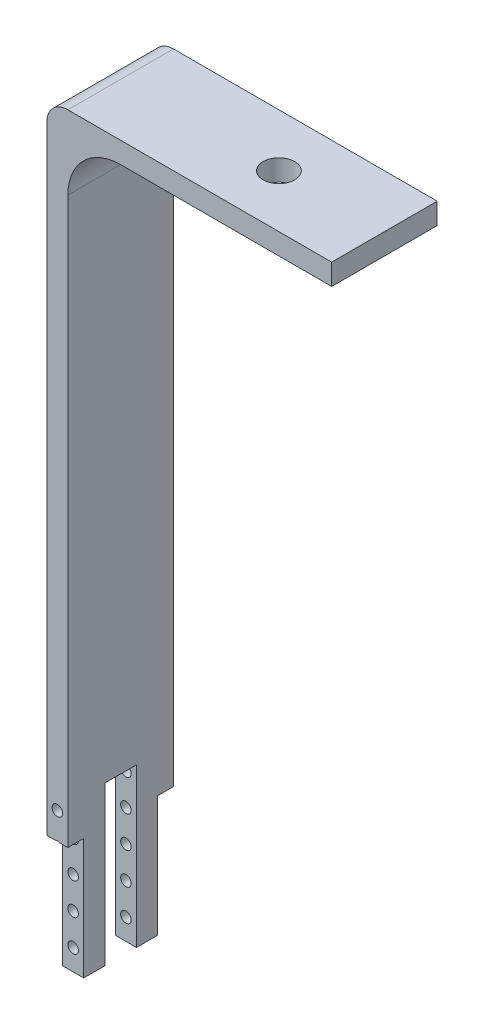
ISO-10303-21;
HEADER;
FILE_DESCRIPTION(('STEP AP214'),'2;1');
FILE_NAME('part.step','',(''),(''),'','','');
FILE_SCHEMA(('AUTOMOTIVE_DESIGN { 1 0 10303 214 1 1 1 1 }'));
ENDSEC;
DATA;
#1=APPLICATION_CONTEXT('core data for automotive mechanical design processes');
#2=APPLICATION_PROTOCOL_DEFINITION('international standard','automotive_design',2000,#1);
#3=PRODUCT_CONTEXT('',#1,'mechanical');
#4=PRODUCT('Part','Part','',(#3));
#5=PRODUCT_RELATED_PRODUCT_CATEGORY('part','',(#4));
#6=PRODUCT_DEFINITION_FORMATION('','',#4);
#7=PRODUCT_DEFINITION_CONTEXT('part definition',#1,'design');
#8=PRODUCT_DEFINITION('design','',#6,#7);
#9=PRODUCT_DEFINITION_SHAPE('','',#8);
#10=(LENGTH_UNIT() NAMED_UNIT(*) SI_UNIT(.MILLI.,.METRE.));
#11=(NAMED_UNIT(*) PLANE_ANGLE_UNIT() SI_UNIT($,.RADIAN.));
#12=(NAMED_UNIT(*) SI_UNIT($,.STERADIAN.) SOLID_ANGLE_UNIT());
#13=UNCERTAINTY_MEASURE_WITH_UNIT(LENGTH_MEASURE(1.E-05),#10,'distance_accuracy_value','');
#14=(GEOMETRIC_REPRESENTATION_CONTEXT(3) GLOBAL_UNCERTAINTY_ASSIGNED_CONTEXT((#13)) GLOBAL_UNIT_ASSIGNED_CONTEXT((#10,
#11,#12)) REPRESENTATION_CONTEXT('',''));
#15=CARTESIAN_POINT('',(0.,0.,0.));
#16=DIRECTION('',(0.,0.,1.));
#17=DIRECTION('',(1.,0.,0.));
#18=AXIS2_PLACEMENT_3D('',#15,#16,#17);
#19=CARTESIAN_POINT('',(-39.7987972115879,-20.1415462708194,1.5));
#20=DIRECTION('',(0.,1.,0.));
#21=DIRECTION('',(0.,0.,1.));
#22=AXIS2_PLACEMENT_3D('',#19,#20,#21);
#23=PLANE('',#22);
#24=DIRECTION('',(1.,0.,0.));
#25=VECTOR('',#24,1.);
#26=CARTESIAN_POINT('',(0.,-20.1415462708194,0.));
#27=LINE('',#26,#25);
#28=CARTESIAN_POINT('',(-31.7987972115879,-20.1415462708194,0.));
#29=VERTEX_POINT('',#28);
#30=CARTESIAN_POINT('',(-31.0068716809958,-20.1415462708194,0.));
#31=VERTEX_POINT('',#30);
#32=EDGE_CURVE('E193',#29,#31,#27,.T.);
#33=ORIENTED_EDGE('',*,*,#32,.T.);
#34=DIRECTION('',(0.,0.,1.));
#35=VECTOR('',#34,1.);
#36=CARTESIAN_POINT('',(-31.0068716809958,-20.1415462708194,-13.5));
#37=LINE('',#36,#35);
#38=CARTESIAN_POINT('',(-31.0068716809958,-20.1415462708194,1.5));
#39=VERTEX_POINT('',#38);
#40=EDGE_CURVE('E214',#31,#39,#37,.T.);
#41=ORIENTED_EDGE('',*,*,#40,.T.);
#42=DIRECTION('',(1.,0.,0.));
#43=VECTOR('',#42,1.);
#44=CARTESIAN_POINT('',(-39.7987972115879,-20.1415462708194,1.5));
#45=LINE('',#44,#43);
#46=CARTESIAN_POINT('',(-31.7987972115879,-20.1415462708194,1.5));
#47=VERTEX_POINT('',#46);
#48=EDGE_CURVE('E356',#47,#39,#45,.T.);
#49=ORIENTED_EDGE('',*,*,#48,.F.);
#50=DIRECTION('',(0.,0.,1.));
#51=VECTOR('',#50,1.);
#52=CARTESIAN_POINT('',(-31.7987972115879,-20.1415462708194,10.));
#53=LINE('',#52,#51);
#54=EDGE_CURVE('E373',#29,#47,#53,.T.);
#55=ORIENTED_EDGE('',*,*,#54,.F.);
#56=EDGE_LOOP('',(#33,#41,#49,#55));
#57=FACE_BOUND('',#56,.T.);
#58=ADVANCED_FACE('F33',(#57),#23,.F.);
#59=CARTESIAN_POINT('',(-39.7987972115879,-20.1415462708194,8.5));
#60=DIRECTION('',(0.,1.,0.));
#61=DIRECTION('',(0.,0.,1.));
#62=AXIS2_PLACEMENT_3D('',#59,#60,#61);
#63=PLANE('',#62);
#64=DIRECTION('',(1.,0.,0.));
#65=VECTOR('',#64,1.);
#66=CARTESIAN_POINT('',(-39.7987972115879,-20.1415462708194,8.5));
#67=LINE('',#66,#65);
#68=CARTESIAN_POINT('',(-31.7987972115879,-20.1415462708194,8.5));
#69=VERTEX_POINT('',#68);
#70=CARTESIAN_POINT('',(-31.0068716809958,-20.1415462708194,8.5));
#71=VERTEX_POINT('',#70);
#72=EDGE_CURVE('E374',#69,#71,#67,.T.);
#73=ORIENTED_EDGE('',*,*,#72,.T.);
#74=DIRECTION('',(0.,0.,1.));
#75=VECTOR('',#74,1.);
#76=CARTESIAN_POINT('',(-31.0068716809958,-20.1415462708194,-13.5));
#77=LINE('',#76,#75);
#78=CARTESIAN_POINT('',(-31.0068716809958,-20.1415462708194,10.));
#79=VERTEX_POINT('',#78);
#80=EDGE_CURVE('E187',#71,#79,#77,.T.);
#81=ORIENTED_EDGE('',*,*,#80,.T.);
#82=DIRECTION('',(1.,0.,0.));
#83=VECTOR('',#82,1.);
#84=CARTESIAN_POINT('',(0.,-20.1415462708194,10.));
#85=LINE('',#84,#83);
#86=CARTESIAN_POINT('',(-31.7987972115879,-20.1415462708194,10.));
#87=VERTEX_POINT('',#86);
#88=EDGE_CURVE('E186',#87,#79,#85,.T.);
#89=ORIENTED_EDGE('',*,*,#88,.F.);
#90=DIRECTION('',(0.,0.,1.));
#91=VECTOR('',#90,1.);
#92=CARTESIAN_POINT('',(-31.7987972115879,-20.1415462708194,10.));
#93=LINE('',#92,#91);
#94=EDGE_CURVE('E304',#69,#87,#93,.T.);
#95=ORIENTED_EDGE('',*,*,#94,.F.);
#96=EDGE_LOOP('',(#73,#81,#89,#95));
#97=FACE_BOUND('',#96,.T.);
#98=ADVANCED_FACE('F378',(#97),#63,.F.);
#99=CARTESIAN_POINT('',(-31.7987972115879,-31.5961945031713,10.));
#100=DIRECTION('',(0.,1.,0.));
#101=DIRECTION('',(-1.,0.,0.));
#102=AXIS2_PLACEMENT_3D('',#99,#100,#101);
#103=PLANE('',#102);
#104=DIRECTION('',(0.,0.,-1.));
#105=VECTOR('',#104,1.);
#106=CARTESIAN_POINT('',(-31.7987972115879,-31.5961945031713,10.));
#107=LINE('',#106,#105);
#108=CARTESIAN_POINT('',(-31.7987972115879,-31.5961945031712,3.5));
#109=VERTEX_POINT('',#108);
#110=CARTESIAN_POINT('',(-31.7987972115879,-31.5961945031712,1.5));
#111=VERTEX_POINT('',#110);
#112=EDGE_CURVE('E274',#109,#111,#107,.T.);
#113=ORIENTED_EDGE('',*,*,#112,.T.);
#114=DIRECTION('',(1.,0.,0.));
#115=VECTOR('',#114,1.);
#116=CARTESIAN_POINT('',(-39.7987972115879,-31.5961945031712,1.5));
#117=LINE('',#116,#115);
#118=CARTESIAN_POINT('',(-29.7987972115879,-31.5961945031712,1.5));
#119=VERTEX_POINT('',#118);
#120=EDGE_CURVE('E352',#111,#119,#117,.T.);
#121=ORIENTED_EDGE('',*,*,#120,.T.);
#122=DIRECTION('',(0.,0.,-1.));
#123=VECTOR('',#122,1.);
#124=CARTESIAN_POINT('',(-29.7987972115879,-31.5961945031712,10.));
#125=LINE('',#124,#123);
#126=CARTESIAN_POINT('',(-29.7987972115879,-31.5961945031712,3.5));
#127=VERTEX_POINT('',#126);
#128=EDGE_CURVE('E269',#127,#119,#125,.T.);
#129=ORIENTED_EDGE('',*,*,#128,.F.);
#130=DIRECTION('',(1.,0.,0.));
#131=VECTOR('',#130,1.);
#132=CARTESIAN_POINT('',(-39.7987972115879,-31.5961945031712,3.5));
#133=LINE('',#132,#131);
#134=EDGE_CURVE('E344',#109,#127,#133,.T.);
#135=ORIENTED_EDGE('',*,*,#134,.F.);
#136=EDGE_LOOP('',(#113,#121,#129,#135));
#137=FACE_BOUND('',#136,.T.);
#138=ADVANCED_FACE('F441',(#137),#103,.F.);
#139=CARTESIAN_POINT('',(-4.79879721158793,40.4038054968287,10.));
#140=DIRECTION('',(-1.,0.,0.));
#141=DIRECTION('',(0.,0.,1.));
#142=AXIS2_PLACEMENT_3D('',#139,#140,#141);
#143=PLANE('',#142);
#144=DIRECTION('',(0.,1.,0.));
#145=VECTOR('',#144,1.);
#146=CARTESIAN_POINT('',(-4.79879721158793,40.4038054968287,0.));
#147=LINE('',#146,#145);
#148=CARTESIAN_POINT('',(-4.79879721158793,38.4038054968287,0.));
#149=VERTEX_POINT('',#148);
#150=CARTESIAN_POINT('',(-4.79879721158793,40.4038054968287,0.));
#151=VERTEX_POINT('',#150);
#152=EDGE_CURVE('E260',#149,#151,#147,.T.);
#153=ORIENTED_EDGE('',*,*,#152,.T.);
#154=DIRECTION('',(0.,0.,-1.));
#155=VECTOR('',#154,1.);
#156=CARTESIAN_POINT('',(-4.79879721158793,40.4038054968287,10.));
#157=LINE('',#156,#155);
#158=CARTESIAN_POINT('',(-4.79879721158793,40.4038054968287,10.));
#159=VERTEX_POINT('',#158);
#160=EDGE_CURVE('E277',#159,#151,#157,.T.);
#161=ORIENTED_EDGE('',*,*,#160,.F.);
#162=DIRECTION('',(0.,1.,0.));
#163=VECTOR('',#162,1.);
#164=CARTESIAN_POINT('',(-4.79879721158793,40.4038054968287,10.));
#165=LINE('',#164,#163);
#166=CARTESIAN_POINT('',(-4.79879721158793,38.4038054968287,10.));
#167=VERTEX_POINT('',#166);
#168=EDGE_CURVE('E265',#167,#159,#165,.T.);
#169=ORIENTED_EDGE('',*,*,#168,.F.);
#170=DIRECTION('',(0.,0.,-1.));
#171=VECTOR('',#170,1.);
#172=CARTESIAN_POINT('',(-4.79879721158793,38.4038054968287,10.));
#173=LINE('',#172,#171);
#174=EDGE_CURVE('E266',#167,#149,#173,.T.);
#175=ORIENTED_EDGE('',*,*,#174,.T.);
#176=EDGE_LOOP('',(#153,#161,#169,#175));
#177=FACE_BOUND('',#176,.T.);
#178=ADVANCED_FACE('F320',(#177),#143,.F.);
#179=CARTESIAN_POINT('',(-4.79879721158793,40.4038054968287,10.));
#180=DIRECTION('',(0.,-1.,0.));
#181=DIRECTION('',(0.,0.,-1.));
#182=AXIS2_PLACEMENT_3D('',#179,#180,#181);
#183=PLANE('',#182);
#184=CARTESIAN_POINT('',(-14.7987972115879,40.4038054968287,5.));
#185=DIRECTION('',(0.,1.,0.));
#186=DIRECTION('',(0.,0.,1.));
#187=AXIS2_PLACEMENT_3D('',#184,#185,#186);
#188=CIRCLE('',#187,1.5);
#189=CARTESIAN_POINT('',(-14.7987972115879,40.4038054968287,6.5));
#190=VERTEX_POINT('',#189);
#191=EDGE_CURVE('E227',#190,#190,#188,.T.);
#192=ORIENTED_EDGE('',*,*,#191,.F.);
#193=EDGE_LOOP('',(#192));
#194=FACE_BOUND('',#193,.T.);
#195=DIRECTION('',(-1.,0.,0.));
#196=VECTOR('',#195,1.);
#197=CARTESIAN_POINT('',(-4.79879721158793,40.4038054968287,0.));
#198=LINE('',#197,#196);
#199=CARTESIAN_POINT('',(-29.7987972115879,40.4038054968287,0.));
#200=VERTEX_POINT('',#199);
#201=EDGE_CURVE('E255',#151,#200,#198,.T.);
#202=ORIENTED_EDGE('',*,*,#201,.T.);
#203=DIRECTION('',(0.,0.,-1.));
#204=VECTOR('',#203,1.);
#205=CARTESIAN_POINT('',(-29.7987972115879,40.4038054968287,10.));
#206=LINE('',#205,#204);
#207=CARTESIAN_POINT('',(-29.7987972115879,40.4038054968287,10.));
#208=VERTEX_POINT('',#207);
#209=EDGE_CURVE('E41',#200,#208,#206,.F.);
#210=ORIENTED_EDGE('',*,*,#209,.T.);
#211=DIRECTION('',(-1.,0.,0.));
#212=VECTOR('',#211,1.);
#213=CARTESIAN_POINT('',(-4.79879721158793,40.4038054968287,10.));
#214=LINE('',#213,#212);
#215=EDGE_CURVE('E313',#159,#208,#214,.T.);
#216=ORIENTED_EDGE('',*,*,#215,.F.);
#217=ORIENTED_EDGE('',*,*,#160,.T.);
#218=EDGE_LOOP('',(#202,#210,#216,#217));
#219=FACE_BOUND('',#218,.T.);
#220=ADVANCED_FACE('F324',(#194,#219),#183,.F.);
#221=CARTESIAN_POINT('',(-31.7987972115879,40.4038054968287,10.));
#222=DIRECTION('',(1.,0.,0.));
#223=DIRECTION('',(0.,0.,-1.));
#224=AXIS2_PLACEMENT_3D('',#221,#222,#223);
#225=PLANE('',#224);
#226=DIRECTION('',(0.,-1.,0.));
#227=VECTOR('',#226,1.);
#228=CARTESIAN_POINT('',(-31.7987972115879,40.4038054968287,10.));
#229=LINE('',#228,#227);
#230=CARTESIAN_POINT('',(-31.7987972115879,38.4038054968287,10.));
#231=VERTEX_POINT('',#230);
#232=EDGE_CURVE('E247',#231,#87,#229,.T.);
#233=ORIENTED_EDGE('',*,*,#232,.F.);
#234=DIRECTION('',(0.,0.,-1.));
#235=VECTOR('',#234,1.);
#236=CARTESIAN_POINT('',(-31.7987972115879,38.4038054968287,10.));
#237=LINE('',#236,#235);
#238=CARTESIAN_POINT('',(-31.7987972115879,38.4038054968287,0.));
#239=VERTEX_POINT('',#238);
#240=EDGE_CURVE('E236',#231,#239,#237,.T.);
#241=ORIENTED_EDGE('',*,*,#240,.T.);
#242=DIRECTION('',(0.,-1.,0.));
#243=VECTOR('',#242,1.);
#244=CARTESIAN_POINT('',(-31.7987972115879,40.4038054968287,0.));
#245=LINE('',#244,#243);
#246=EDGE_CURVE('E244',#239,#29,#245,.T.);
#247=ORIENTED_EDGE('',*,*,#246,.T.);
#248=ORIENTED_EDGE('',*,*,#54,.T.);
#249=DIRECTION('',(0.,-1.,0.));
#250=VECTOR('',#249,1.);
#251=CARTESIAN_POINT('',(-31.7987972115879,40.4038054968287,1.5));
#252=LINE('',#251,#250);
#253=EDGE_CURVE('E302',#47,#111,#252,.T.);
#254=ORIENTED_EDGE('',*,*,#253,.T.);
#255=ORIENTED_EDGE('',*,*,#112,.F.);
#256=DIRECTION('',(0.,1.,0.));
#257=VECTOR('',#256,1.);
#258=CARTESIAN_POINT('',(-31.7987972115879,40.4038054968287,3.50000000000001));
#259=LINE('',#258,#257);
#260=CARTESIAN_POINT('',(-31.7987972115879,-16.5961945031713,3.5));
#261=VERTEX_POINT('',#260);
#262=EDGE_CURVE('E300',#109,#261,#259,.T.);
#263=ORIENTED_EDGE('',*,*,#262,.T.);
#264=DIRECTION('',(0.,0.,1.));
#265=VECTOR('',#264,1.);
#266=CARTESIAN_POINT('',(-31.7987972115879,-16.5961945031712,10.0000000000001));
#267=LINE('',#266,#265);
#268=CARTESIAN_POINT('',(-31.7987972115879,-16.5961945031713,6.5));
#269=VERTEX_POINT('',#268);
#270=EDGE_CURVE('E297',#261,#269,#267,.T.);
#271=ORIENTED_EDGE('',*,*,#270,.T.);
#272=DIRECTION('',(0.,-1.,0.));
#273=VECTOR('',#272,1.);
#274=CARTESIAN_POINT('',(-31.7987972115879,40.4038054968287,6.50000000000001));
#275=LINE('',#274,#273);
#276=CARTESIAN_POINT('',(-31.7987972115879,-31.5961945031712,6.5));
#277=VERTEX_POINT('',#276);
#278=EDGE_CURVE('E295',#269,#277,#275,.T.);
#279=ORIENTED_EDGE('',*,*,#278,.T.);
#280=CARTESIAN_POINT('',(-31.7987972115879,-31.5961945031712,8.5));
#281=VERTEX_POINT('',#280);
#282=EDGE_CURVE('E276',#281,#277,#107,.T.);
#283=ORIENTED_EDGE('',*,*,#282,.F.);
#284=DIRECTION('',(0.,1.,0.));
#285=VECTOR('',#284,1.);
#286=CARTESIAN_POINT('',(-31.7987972115879,40.4038054968287,8.5));
#287=LINE('',#286,#285);
#288=EDGE_CURVE('E293',#281,#69,#287,.T.);
#289=ORIENTED_EDGE('',*,*,#288,.T.);
#290=ORIENTED_EDGE('',*,*,#94,.T.);
#291=EDGE_LOOP('',(#233,#241,#247,#248,#254,#255,#263,#271,#279,#283,#289,#290));
#292=FACE_BOUND('',#291,.T.);
#293=ADVANCED_FACE('F242',(#292),#225,.F.);
#294=CARTESIAN_POINT('',(-29.7987972115879,-31.5961945031712,8.5));
#295=VERTEX_POINT('',#294);
#296=CARTESIAN_POINT('',(-29.7987972115879,-31.5961945031712,6.5));
#297=VERTEX_POINT('',#296);
#298=EDGE_CURVE('E273',#295,#297,#125,.T.);
#299=ORIENTED_EDGE('',*,*,#298,.F.);
#300=DIRECTION('',(1.,0.,0.));
#301=VECTOR('',#300,1.);
#302=CARTESIAN_POINT('',(-39.7987972115879,-31.5961945031712,8.5));
#303=LINE('',#302,#301);
#304=EDGE_CURVE('E290',#281,#295,#303,.T.);
#305=ORIENTED_EDGE('',*,*,#304,.F.);
#306=ORIENTED_EDGE('',*,*,#282,.T.);
#307=DIRECTION('',(1.,0.,0.));
#308=VECTOR('',#307,1.);
#309=CARTESIAN_POINT('',(-39.7987972115879,-31.5961945031712,6.5));
#310=LINE('',#309,#308);
#311=EDGE_CURVE('E288',#277,#297,#310,.T.);
#312=ORIENTED_EDGE('',*,*,#311,.T.);
#313=EDGE_LOOP('',(#299,#305,#306,#312));
#314=FACE_BOUND('',#313,.T.);
#315=ADVANCED_FACE('F287',(#314),#103,.F.);
#316=CARTESIAN_POINT('',(-29.7987972115879,38.4038054968288,10.));
#317=DIRECTION('',(-1.,0.,0.));
#318=DIRECTION('',(0.,0.,1.));
#319=AXIS2_PLACEMENT_3D('',#316,#317,#318);
#320=PLANE('',#319);
#321=DIRECTION('',(0.,1.,0.));
#322=VECTOR('',#321,1.);
#323=CARTESIAN_POINT('',(-29.7987972115879,38.4038054968288,0.));
#324=LINE('',#323,#322);
#325=CARTESIAN_POINT('',(-29.7987972115879,-20.1415462708194,0.));
#326=VERTEX_POINT('',#325);
#327=CARTESIAN_POINT('',(-29.7987972115879,33.4038054968288,0.));
#328=VERTEX_POINT('',#327);
#329=EDGE_CURVE('E254',#326,#328,#324,.T.);
#330=ORIENTED_EDGE('',*,*,#329,.T.);
#331=DIRECTION('',(0.,0.,-1.));
#332=VECTOR('',#331,1.);
#333=CARTESIAN_POINT('',(-29.7987972115879,33.4038054968288,10.));
#334=LINE('',#333,#332);
#335=CARTESIAN_POINT('',(-29.7987972115879,33.4038054968288,10.));
#336=VERTEX_POINT('',#335);
#337=EDGE_CURVE('E230',#328,#336,#334,.F.);
#338=ORIENTED_EDGE('',*,*,#337,.T.);
#339=DIRECTION('',(0.,1.,0.));
#340=VECTOR('',#339,1.);
#341=CARTESIAN_POINT('',(-29.7987972115879,38.4038054968288,10.));
#342=LINE('',#341,#340);
#343=CARTESIAN_POINT('',(-29.7987972115879,-20.1415462708194,10.));
#344=VERTEX_POINT('',#343);
#345=EDGE_CURVE('E316',#344,#336,#342,.T.);
#346=ORIENTED_EDGE('',*,*,#345,.F.);
#347=DIRECTION('',(0.,0.,1.));
#348=VECTOR('',#347,1.);
#349=CARTESIAN_POINT('',(-29.7987972115879,-20.1415462708194,8.5));
#350=LINE('',#349,#348);
#351=CARTESIAN_POINT('',(-29.7987972115879,-20.1415462708194,8.5));
#352=VERTEX_POINT('',#351);
#353=EDGE_CURVE('E191',#352,#344,#350,.T.);
#354=ORIENTED_EDGE('',*,*,#353,.F.);
#355=DIRECTION('',(0.,1.,0.));
#356=VECTOR('',#355,1.);
#357=CARTESIAN_POINT('',(-29.7987972115879,-31.5961945031712,8.5));
#358=LINE('',#357,#356);
#359=EDGE_CURVE('E355',#295,#352,#358,.T.);
#360=ORIENTED_EDGE('',*,*,#359,.F.);
#361=ORIENTED_EDGE('',*,*,#298,.T.);
#362=DIRECTION('',(0.,-1.,0.));
#363=VECTOR('',#362,1.);
#364=CARTESIAN_POINT('',(-29.7987972115879,-16.5961945031713,6.5));
#365=LINE('',#364,#363);
#366=CARTESIAN_POINT('',(-29.7987972115879,-16.5961945031713,6.5));
#367=VERTEX_POINT('',#366);
#368=EDGE_CURVE('E365',#367,#297,#365,.T.);
#369=ORIENTED_EDGE('',*,*,#368,.F.);
#370=DIRECTION('',(0.,0.,1.));
#371=VECTOR('',#370,1.);
#372=CARTESIAN_POINT('',(-29.7987972115879,-16.5961945031713,6.5));
#373=LINE('',#372,#371);
#374=CARTESIAN_POINT('',(-29.7987972115879,-16.5961945031713,3.5));
#375=VERTEX_POINT('',#374);
#376=EDGE_CURVE('E361',#375,#367,#373,.T.);
#377=ORIENTED_EDGE('',*,*,#376,.F.);
#378=DIRECTION('',(0.,1.,0.));
#379=VECTOR('',#378,1.);
#380=CARTESIAN_POINT('',(-29.7987972115879,-16.5961945031713,3.5));
#381=LINE('',#380,#379);
#382=EDGE_CURVE('E359',#127,#375,#381,.T.);
#383=ORIENTED_EDGE('',*,*,#382,.F.);
#384=ORIENTED_EDGE('',*,*,#128,.T.);
#385=DIRECTION('',(0.,-1.,0.));
#386=VECTOR('',#385,1.);
#387=CARTESIAN_POINT('',(-29.7987972115879,-31.5961945031712,1.5));
#388=LINE('',#387,#386);
#389=CARTESIAN_POINT('',(-29.7987972115879,-20.1415462708194,1.5));
#390=VERTEX_POINT('',#389);
#391=EDGE_CURVE('E341',#390,#119,#388,.T.);
#392=ORIENTED_EDGE('',*,*,#391,.F.);
#393=DIRECTION('',(0.,0.,1.));
#394=VECTOR('',#393,1.);
#395=CARTESIAN_POINT('',(-29.7987972115879,-20.1415462708194,1.5));
#396=LINE('',#395,#394);
#397=EDGE_CURVE('E340',#326,#390,#396,.T.);
#398=ORIENTED_EDGE('',*,*,#397,.F.);
#399=EDGE_LOOP('',(#330,#338,#346,#354,#360,#361,#369,#377,#383,#384,#392,#398));
#400=FACE_BOUND('',#399,.T.);
#401=ADVANCED_FACE('F337',(#400),#320,.F.);
#402=CARTESIAN_POINT('',(-4.79879721158793,38.4038054968287,10.));
#403=DIRECTION('',(0.,1.,0.));
#404=DIRECTION('',(-1.,0.,0.));
#405=AXIS2_PLACEMENT_3D('',#402,#403,#404);
#406=PLANE('',#405);
#407=CARTESIAN_POINT('',(-14.7987972115879,38.4038054968287,5.));
#408=DIRECTION('',(0.,1.,0.));
#409=DIRECTION('',(-1.,0.,0.));
#410=AXIS2_PLACEMENT_3D('',#407,#408,#409);
#411=CIRCLE('',#410,1.5);
#412=CARTESIAN_POINT('',(-16.2987972115879,38.4038054968287,5.));
#413=VERTEX_POINT('',#412);
#414=EDGE_CURVE('E205',#413,#413,#411,.T.);
#415=ORIENTED_EDGE('',*,*,#414,.T.);
#416=EDGE_LOOP('',(#415));
#417=FACE_BOUND('',#416,.T.);
#418=DIRECTION('',(1.,0.,0.));
#419=VECTOR('',#418,1.);
#420=CARTESIAN_POINT('',(-4.79879721158793,38.4038054968287,10.));
#421=LINE('',#420,#419);
#422=CARTESIAN_POINT('',(-24.7987972115879,38.4038054968288,10.));
#423=VERTEX_POINT('',#422);
#424=EDGE_CURVE('E270',#423,#167,#421,.T.);
#425=ORIENTED_EDGE('',*,*,#424,.F.);
#426=DIRECTION('',(0.,0.,-1.));
#427=VECTOR('',#426,1.);
#428=CARTESIAN_POINT('',(-24.7987972115879,38.4038054968288,0.));
#429=LINE('',#428,#427);
#430=CARTESIAN_POINT('',(-24.7987972115879,38.4038054968288,0.));
#431=VERTEX_POINT('',#430);
#432=EDGE_CURVE('E195',#423,#431,#429,.T.);
#433=ORIENTED_EDGE('',*,*,#432,.T.);
#434=DIRECTION('',(1.,0.,0.));
#435=VECTOR('',#434,1.);
#436=CARTESIAN_POINT('',(-4.79879721158793,38.4038054968287,0.));
#437=LINE('',#436,#435);
#438=EDGE_CURVE('E258',#431,#149,#437,.T.);
#439=ORIENTED_EDGE('',*,*,#438,.T.);
#440=ORIENTED_EDGE('',*,*,#174,.F.);
#441=EDGE_LOOP('',(#425,#433,#439,#440));
#442=FACE_BOUND('',#441,.T.);
#443=ADVANCED_FACE('F329',(#417,#442),#406,.F.);
#444=CARTESIAN_POINT('',(0.,0.,10.));
#445=DIRECTION('',(0.,0.,-1.));
#446=DIRECTION('',(-1.,0.,0.));
#447=AXIS2_PLACEMENT_3D('',#444,#445,#446);
#448=PLANE('',#447);
#449=CARTESIAN_POINT('',(-30.7987972115879,-17.5961945031712,10.));
#450=DIRECTION('',(0.,0.,-1.));
#451=DIRECTION('',(-1.,0.,0.));
#452=AXIS2_PLACEMENT_3D('',#449,#450,#451);
#453=CIRCLE('',#452,0.499999999999999);
#454=CARTESIAN_POINT('',(-31.2987972115879,-17.5961945031712,10.));
#455=VERTEX_POINT('',#454);
#456=EDGE_CURVE('E209',#455,#455,#453,.T.);
#457=ORIENTED_EDGE('',*,*,#456,.T.);
#458=EDGE_LOOP('',(#457));
#459=FACE_BOUND('',#458,.T.);
#460=ORIENTED_EDGE('',*,*,#215,.T.);
#461=CARTESIAN_POINT('',(-29.7987972115879,38.4038054968287,10.));
#462=DIRECTION('',(0.,0.,-1.));
#463=DIRECTION('',(-1.,0.,0.));
#464=AXIS2_PLACEMENT_3D('',#461,#462,#463);
#465=CIRCLE('',#464,2.);
#466=EDGE_CURVE('E11',#208,#231,#465,.F.);
#467=ORIENTED_EDGE('',*,*,#466,.T.);
#468=ORIENTED_EDGE('',*,*,#232,.T.);
#469=ORIENTED_EDGE('',*,*,#88,.T.);
#470=CARTESIAN_POINT('',(-30.7987972115879,-20.5961945031712,10.));
#471=DIRECTION('',(0.,0.,-1.));
#472=DIRECTION('',(-1.,0.,0.));
#473=AXIS2_PLACEMENT_3D('',#470,#471,#472);
#474=CIRCLE('',#473,0.499999999999999);
#475=CARTESIAN_POINT('',(-30.5907227421801,-20.1415462708194,10.));
#476=VERTEX_POINT('',#475);
#477=EDGE_CURVE('E170',#79,#476,#474,.T.);
#478=ORIENTED_EDGE('',*,*,#477,.T.);
#479=EDGE_CURVE('E183',#476,#344,#85,.T.);
#480=ORIENTED_EDGE('',*,*,#479,.T.);
#481=ORIENTED_EDGE('',*,*,#345,.T.);
#482=CARTESIAN_POINT('',(-24.7987972115879,33.4038054968288,10.));
#483=DIRECTION('',(0.,0.,-1.));
#484=DIRECTION('',(-1.,0.,0.));
#485=AXIS2_PLACEMENT_3D('',#482,#483,#484);
#486=CIRCLE('',#485,5.);
#487=EDGE_CURVE('E234',#336,#423,#486,.T.);
#488=ORIENTED_EDGE('',*,*,#487,.T.);
#489=ORIENTED_EDGE('',*,*,#424,.T.);
#490=ORIENTED_EDGE('',*,*,#168,.T.);
#491=EDGE_LOOP('',(#460,#467,#468,#469,#478,#480,#481,#488,#489,#490));
#492=FACE_BOUND('',#491,.T.);
#493=ADVANCED_FACE('F181',(#459,#492),#448,.F.);
#494=CARTESIAN_POINT('',(0.,0.,0.));
#495=DIRECTION('',(0.,0.,-1.));
#496=DIRECTION('',(-1.,0.,0.));
#497=AXIS2_PLACEMENT_3D('',#494,#495,#496);
#498=PLANE('',#497);
#499=ORIENTED_EDGE('',*,*,#246,.F.);
#500=CARTESIAN_POINT('',(-29.7987972115879,38.4038054968287,0.));
#501=DIRECTION('',(0.,0.,-1.));
#502=DIRECTION('',(-1.,0.,0.));
#503=AXIS2_PLACEMENT_3D('',#500,#501,#502);
#504=CIRCLE('',#503,2.);
#505=EDGE_CURVE('E55',#239,#200,#504,.T.);
#506=ORIENTED_EDGE('',*,*,#505,.T.);
#507=ORIENTED_EDGE('',*,*,#201,.F.);
#508=ORIENTED_EDGE('',*,*,#152,.F.);
#509=ORIENTED_EDGE('',*,*,#438,.F.);
#510=CARTESIAN_POINT('',(-24.7987972115879,33.4038054968288,0.));
#511=DIRECTION('',(0.,0.,-1.));
#512=DIRECTION('',(-1.,0.,0.));
#513=AXIS2_PLACEMENT_3D('',#510,#511,#512);
#514=CIRCLE('',#513,5.);
#515=EDGE_CURVE('E232',#431,#328,#514,.F.);
#516=ORIENTED_EDGE('',*,*,#515,.T.);
#517=ORIENTED_EDGE('',*,*,#329,.F.);
#518=CARTESIAN_POINT('',(-30.5907227421801,-20.1415462708194,0.));
#519=VERTEX_POINT('',#518);
#520=EDGE_CURVE('E197',#519,#326,#27,.T.);
#521=ORIENTED_EDGE('',*,*,#520,.F.);
#522=CARTESIAN_POINT('',(-30.7987972115879,-20.5961945031712,0.));
#523=DIRECTION('',(0.,0.,-1.));
#524=DIRECTION('',(-1.,0.,0.));
#525=AXIS2_PLACEMENT_3D('',#522,#523,#524);
#526=CIRCLE('',#525,0.499999999999999);
#527=EDGE_CURVE('E409',#31,#519,#526,.T.);
#528=ORIENTED_EDGE('',*,*,#527,.F.);
#529=ORIENTED_EDGE('',*,*,#32,.F.);
#530=EDGE_LOOP('',(#499,#506,#507,#508,#509,#516,#517,#521,#528,#529));
#531=FACE_BOUND('',#530,.T.);
#532=CARTESIAN_POINT('',(-30.7987972115879,-17.5961945031712,0.));
#533=DIRECTION('',(0.,0.,-1.));
#534=DIRECTION('',(-1.,0.,0.));
#535=AXIS2_PLACEMENT_3D('',#532,#533,#534);
#536=CIRCLE('',#535,0.499999999999999);
#537=CARTESIAN_POINT('',(-31.2987972115879,-17.5961945031712,0.));
#538=VERTEX_POINT('',#537);
#539=EDGE_CURVE('E423',#538,#538,#536,.T.);
#540=ORIENTED_EDGE('',*,*,#539,.F.);
#541=EDGE_LOOP('',(#540));
#542=FACE_BOUND('',#541,.T.);
#543=ADVANCED_FACE('F251',(#531,#542),#498,.T.);
#544=CARTESIAN_POINT('',(-39.7987972115879,-31.5961945031712,1.5));
#545=DIRECTION('',(0.,0.,1.));
#546=DIRECTION('',(1.,0.,0.));
#547=AXIS2_PLACEMENT_3D('',#544,#545,#546);
#548=PLANE('',#547);
#549=CARTESIAN_POINT('',(-30.7987972115879,-29.5961945031712,1.5));
#550=DIRECTION('',(0.,0.,1.));
#551=DIRECTION('',(1.,0.,0.));
#552=AXIS2_PLACEMENT_3D('',#549,#550,#551);
#553=CIRCLE('',#552,0.499999999999999);
#554=CARTESIAN_POINT('',(-30.2987972115879,-29.5961945031712,1.5));
#555=VERTEX_POINT('',#554);
#556=EDGE_CURVE('E362',#555,#555,#553,.T.);
#557=ORIENTED_EDGE('',*,*,#556,.T.);
#558=EDGE_LOOP('',(#557));
#559=FACE_BOUND('',#558,.T.);
#560=CARTESIAN_POINT('',(-30.7987972115879,-26.5961945031712,1.5));
#561=DIRECTION('',(0.,0.,1.));
#562=DIRECTION('',(1.,0.,0.));
#563=AXIS2_PLACEMENT_3D('',#560,#561,#562);
#564=CIRCLE('',#563,0.499999999999999);
#565=CARTESIAN_POINT('',(-30.2987972115879,-26.5961945031712,1.5));
#566=VERTEX_POINT('',#565);
#567=EDGE_CURVE('E224',#566,#566,#564,.T.);
#568=ORIENTED_EDGE('',*,*,#567,.T.);
#569=EDGE_LOOP('',(#568));
#570=FACE_BOUND('',#569,.T.);
#571=CARTESIAN_POINT('',(-30.7987972115879,-23.5961945031712,1.5));
#572=DIRECTION('',(0.,0.,1.));
#573=DIRECTION('',(1.,0.,0.));
#574=AXIS2_PLACEMENT_3D('',#571,#572,#573);
#575=CIRCLE('',#574,0.499999999999999);
#576=CARTESIAN_POINT('',(-30.2987972115879,-23.5961945031712,1.5));
#577=VERTEX_POINT('',#576);
#578=EDGE_CURVE('E219',#577,#577,#575,.T.);
#579=ORIENTED_EDGE('',*,*,#578,.T.);
#580=EDGE_LOOP('',(#579));
#581=FACE_BOUND('',#580,.T.);
#582=ORIENTED_EDGE('',*,*,#48,.T.);
#583=CARTESIAN_POINT('',(-30.7987972115879,-20.5961945031712,1.5));
#584=DIRECTION('',(0.,0.,1.));
#585=DIRECTION('',(1.,0.,0.));
#586=AXIS2_PLACEMENT_3D('',#583,#584,#585);
#587=CIRCLE('',#586,0.499999999999999);
#588=CARTESIAN_POINT('',(-30.5907227421801,-20.1415462708194,1.5));
#589=VERTEX_POINT('',#588);
#590=EDGE_CURVE('E411',#39,#589,#587,.T.);
#591=ORIENTED_EDGE('',*,*,#590,.T.);
#592=EDGE_CURVE('E346',#589,#390,#45,.T.);
#593=ORIENTED_EDGE('',*,*,#592,.T.);
#594=ORIENTED_EDGE('',*,*,#391,.T.);
#595=ORIENTED_EDGE('',*,*,#120,.F.);
#596=ORIENTED_EDGE('',*,*,#253,.F.);
#597=EDGE_LOOP('',(#582,#591,#593,#594,#595,#596));
#598=FACE_BOUND('',#597,.T.);
#599=ADVANCED_FACE('F454',(#559,#570,#581,#598),#548,.F.);
#600=ORIENTED_EDGE('',*,*,#592,.F.);
#601=DIRECTION('',(0.,0.,1.));
#602=VECTOR('',#601,1.);
#603=CARTESIAN_POINT('',(-30.5907227421801,-20.1415462708194,-13.5));
#604=LINE('',#603,#602);
#605=EDGE_CURVE('E414',#589,#519,#604,.F.);
#606=ORIENTED_EDGE('',*,*,#605,.T.);
#607=ORIENTED_EDGE('',*,*,#520,.T.);
#608=ORIENTED_EDGE('',*,*,#397,.T.);
#609=EDGE_LOOP('',(#600,#606,#607,#608));
#610=FACE_BOUND('',#609,.T.);
#611=ADVANCED_FACE('F446',(#610),#23,.F.);
#612=CARTESIAN_POINT('',(-39.7987972115879,-31.5961945031712,8.5));
#613=DIRECTION('',(0.,0.,-1.));
#614=DIRECTION('',(-1.,0.,0.));
#615=AXIS2_PLACEMENT_3D('',#612,#613,#614);
#616=PLANE('',#615);
#617=CARTESIAN_POINT('',(-30.7987972115879,-29.5961945031712,8.5));
#618=DIRECTION('',(0.,0.,-1.));
#619=DIRECTION('',(-1.,0.,0.));
#620=AXIS2_PLACEMENT_3D('',#617,#618,#619);
#621=CIRCLE('',#620,0.499999999999999);
#622=CARTESIAN_POINT('',(-31.2987972115879,-29.5961945031712,8.5));
#623=VERTEX_POINT('',#622);
#624=EDGE_CURVE('E388',#623,#623,#621,.T.);
#625=ORIENTED_EDGE('',*,*,#624,.T.);
#626=EDGE_LOOP('',(#625));
#627=FACE_BOUND('',#626,.T.);
#628=CARTESIAN_POINT('',(-30.7987972115879,-26.5961945031712,8.5));
#629=DIRECTION('',(0.,0.,-1.));
#630=DIRECTION('',(-1.,0.,0.));
#631=AXIS2_PLACEMENT_3D('',#628,#629,#630);
#632=CIRCLE('',#631,0.499999999999999);
#633=CARTESIAN_POINT('',(-31.2987972115879,-26.5961945031712,8.5));
#634=VERTEX_POINT('',#633);
#635=EDGE_CURVE('E395',#634,#634,#632,.T.);
#636=ORIENTED_EDGE('',*,*,#635,.T.);
#637=EDGE_LOOP('',(#636));
#638=FACE_BOUND('',#637,.T.);
#639=CARTESIAN_POINT('',(-30.7987972115879,-23.5961945031712,8.5));
#640=DIRECTION('',(0.,0.,-1.));
#641=DIRECTION('',(-1.,0.,0.));
#642=AXIS2_PLACEMENT_3D('',#639,#640,#641);
#643=CIRCLE('',#642,0.499999999999999);
#644=CARTESIAN_POINT('',(-31.2987972115879,-23.5961945031712,8.5));
#645=VERTEX_POINT('',#644);
#646=EDGE_CURVE('E402',#645,#645,#643,.T.);
#647=ORIENTED_EDGE('',*,*,#646,.T.);
#648=EDGE_LOOP('',(#647));
#649=FACE_BOUND('',#648,.T.);
#650=CARTESIAN_POINT('',(-30.5907227421801,-20.1415462708194,8.5));
#651=VERTEX_POINT('',#650);
#652=EDGE_CURVE('E381',#651,#352,#67,.T.);
#653=ORIENTED_EDGE('',*,*,#652,.F.);
#654=CARTESIAN_POINT('',(-30.7987972115879,-20.5961945031712,8.5));
#655=DIRECTION('',(0.,0.,-1.));
#656=DIRECTION('',(-1.,0.,0.));
#657=AXIS2_PLACEMENT_3D('',#654,#655,#656);
#658=CIRCLE('',#657,0.499999999999999);
#659=EDGE_CURVE('E173',#651,#71,#658,.T.);
#660=ORIENTED_EDGE('',*,*,#659,.T.);
#661=ORIENTED_EDGE('',*,*,#72,.F.);
#662=ORIENTED_EDGE('',*,*,#288,.F.);
#663=ORIENTED_EDGE('',*,*,#304,.T.);
#664=ORIENTED_EDGE('',*,*,#359,.T.);
#665=EDGE_LOOP('',(#653,#660,#661,#662,#663,#664));
#666=FACE_BOUND('',#665,.T.);
#667=ADVANCED_FACE('F380',(#627,#638,#649,#666),#616,.F.);
#668=ORIENTED_EDGE('',*,*,#479,.F.);
#669=DIRECTION('',(0.,0.,1.));
#670=VECTOR('',#669,1.);
#671=CARTESIAN_POINT('',(-30.5907227421801,-20.1415462708194,-13.5));
#672=LINE('',#671,#670);
#673=EDGE_CURVE('E167',#476,#651,#672,.F.);
#674=ORIENTED_EDGE('',*,*,#673,.T.);
#675=ORIENTED_EDGE('',*,*,#652,.T.);
#676=ORIENTED_EDGE('',*,*,#353,.T.);
#677=EDGE_LOOP('',(#668,#674,#675,#676));
#678=FACE_BOUND('',#677,.T.);
#679=ADVANCED_FACE('F189',(#678),#63,.F.);
#680=CARTESIAN_POINT('',(-39.7987972115879,-16.5961945031713,3.5));
#681=DIRECTION('',(0.,0.,-1.));
#682=DIRECTION('',(0.,1.,0.));
#683=AXIS2_PLACEMENT_3D('',#680,#681,#682);
#684=PLANE('',#683);
#685=CARTESIAN_POINT('',(-30.7987972115879,-29.5961945031712,3.5));
#686=DIRECTION('',(0.,0.,-1.));
#687=DIRECTION('',(0.,1.,0.));
#688=AXIS2_PLACEMENT_3D('',#685,#686,#687);
#689=CIRCLE('',#688,0.499999999999999);
#690=CARTESIAN_POINT('',(-30.7987972115879,-29.0961945031712,3.5));
#691=VERTEX_POINT('',#690);
#692=EDGE_CURVE('E223',#691,#691,#689,.T.);
#693=ORIENTED_EDGE('',*,*,#692,.T.);
#694=EDGE_LOOP('',(#693));
#695=FACE_BOUND('',#694,.T.);
#696=CARTESIAN_POINT('',(-30.7987972115879,-26.5961945031712,3.5));
#697=DIRECTION('',(0.,0.,-1.));
#698=DIRECTION('',(0.,1.,0.));
#699=AXIS2_PLACEMENT_3D('',#696,#697,#698);
#700=CIRCLE('',#699,0.499999999999999);
#701=CARTESIAN_POINT('',(-30.7987972115879,-26.0961945031712,3.5));
#702=VERTEX_POINT('',#701);
#703=EDGE_CURVE('E218',#702,#702,#700,.T.);
#704=ORIENTED_EDGE('',*,*,#703,.T.);
#705=EDGE_LOOP('',(#704));
#706=FACE_BOUND('',#705,.T.);
#707=CARTESIAN_POINT('',(-30.7987972115879,-23.5961945031712,3.5));
#708=DIRECTION('',(0.,0.,-1.));
#709=DIRECTION('',(0.,1.,0.));
#710=AXIS2_PLACEMENT_3D('',#707,#708,#709);
#711=CIRCLE('',#710,0.499999999999999);
#712=CARTESIAN_POINT('',(-30.7987972115879,-23.0961945031712,3.5));
#713=VERTEX_POINT('',#712);
#714=EDGE_CURVE('E213',#713,#713,#711,.T.);
#715=ORIENTED_EDGE('',*,*,#714,.T.);
#716=EDGE_LOOP('',(#715));
#717=FACE_BOUND('',#716,.T.);
#718=CARTESIAN_POINT('',(-30.7987972115879,-20.5961945031712,3.5));
#719=DIRECTION('',(0.,0.,-1.));
#720=DIRECTION('',(0.,1.,0.));
#721=AXIS2_PLACEMENT_3D('',#718,#719,#720);
#722=CIRCLE('',#721,0.499999999999999);
#723=CARTESIAN_POINT('',(-30.7987972115879,-20.0961945031712,3.5));
#724=VERTEX_POINT('',#723);
#725=EDGE_CURVE('E177',#724,#724,#722,.T.);
#726=ORIENTED_EDGE('',*,*,#725,.T.);
#727=EDGE_LOOP('',(#726));
#728=FACE_BOUND('',#727,.T.);
#729=CARTESIAN_POINT('',(-30.7987972115879,-17.5961945031712,3.5));
#730=DIRECTION('',(0.,0.,-1.));
#731=DIRECTION('',(0.,1.,0.));
#732=AXIS2_PLACEMENT_3D('',#729,#730,#731);
#733=CIRCLE('',#732,0.499999999999999);
#734=CARTESIAN_POINT('',(-30.7987972115879,-17.0961945031712,3.5));
#735=VERTEX_POINT('',#734);
#736=EDGE_CURVE('E204',#735,#735,#733,.T.);
#737=ORIENTED_EDGE('',*,*,#736,.T.);
#738=EDGE_LOOP('',(#737));
#739=FACE_BOUND('',#738,.T.);
#740=ORIENTED_EDGE('',*,*,#134,.T.);
#741=ORIENTED_EDGE('',*,*,#382,.T.);
#742=DIRECTION('',(1.,0.,0.));
#743=VECTOR('',#742,1.);
#744=CARTESIAN_POINT('',(-39.7987972115879,-16.5961945031713,3.5));
#745=LINE('',#744,#743);
#746=EDGE_CURVE('E366',#261,#375,#745,.T.);
#747=ORIENTED_EDGE('',*,*,#746,.F.);
#748=ORIENTED_EDGE('',*,*,#262,.F.);
#749=EDGE_LOOP('',(#740,#741,#747,#748));
#750=FACE_BOUND('',#749,.T.);
#751=ADVANCED_FACE('F472',(#695,#706,#717,#728,#739,#750),#684,.F.);
#752=CARTESIAN_POINT('',(-39.7987972115879,-16.5961945031713,6.5));
#753=DIRECTION('',(0.,0.,1.));
#754=DIRECTION('',(0.,-1.,0.));
#755=AXIS2_PLACEMENT_3D('',#752,#753,#754);
#756=PLANE('',#755);
#757=CARTESIAN_POINT('',(-30.7987972115879,-29.5961945031712,6.5));
#758=DIRECTION('',(0.,0.,1.));
#759=DIRECTION('',(0.,-1.,0.));
#760=AXIS2_PLACEMENT_3D('',#757,#758,#759);
#761=CIRCLE('',#760,0.499999999999999);
#762=CARTESIAN_POINT('',(-30.7987972115879,-30.0961945031712,6.5));
#763=VERTEX_POINT('',#762);
#764=EDGE_CURVE('E220',#763,#763,#761,.T.);
#765=ORIENTED_EDGE('',*,*,#764,.T.);
#766=EDGE_LOOP('',(#765));
#767=FACE_BOUND('',#766,.T.);
#768=CARTESIAN_POINT('',(-30.7987972115879,-26.5961945031712,6.5));
#769=DIRECTION('',(0.,0.,1.));
#770=DIRECTION('',(0.,-1.,0.));
#771=AXIS2_PLACEMENT_3D('',#768,#769,#770);
#772=CIRCLE('',#771,0.499999999999999);
#773=CARTESIAN_POINT('',(-30.7987972115879,-27.0961945031712,6.5));
#774=VERTEX_POINT('',#773);
#775=EDGE_CURVE('E215',#774,#774,#772,.T.);
#776=ORIENTED_EDGE('',*,*,#775,.T.);
#777=EDGE_LOOP('',(#776));
#778=FACE_BOUND('',#777,.T.);
#779=CARTESIAN_POINT('',(-30.7987972115879,-23.5961945031712,6.5));
#780=DIRECTION('',(0.,0.,1.));
#781=DIRECTION('',(0.,-1.,0.));
#782=AXIS2_PLACEMENT_3D('',#779,#780,#781);
#783=CIRCLE('',#782,0.499999999999999);
#784=CARTESIAN_POINT('',(-30.7987972115879,-24.0961945031712,6.5));
#785=VERTEX_POINT('',#784);
#786=EDGE_CURVE('E210',#785,#785,#783,.T.);
#787=ORIENTED_EDGE('',*,*,#786,.T.);
#788=EDGE_LOOP('',(#787));
#789=FACE_BOUND('',#788,.T.);
#790=CARTESIAN_POINT('',(-30.7987972115879,-20.5961945031712,6.5));
#791=DIRECTION('',(0.,0.,1.));
#792=DIRECTION('',(0.,-1.,0.));
#793=AXIS2_PLACEMENT_3D('',#790,#791,#792);
#794=CIRCLE('',#793,0.499999999999999);
#795=CARTESIAN_POINT('',(-30.7987972115879,-21.0961945031712,6.5));
#796=VERTEX_POINT('',#795);
#797=EDGE_CURVE('E206',#796,#796,#794,.T.);
#798=ORIENTED_EDGE('',*,*,#797,.T.);
#799=EDGE_LOOP('',(#798));
#800=FACE_BOUND('',#799,.T.);
#801=CARTESIAN_POINT('',(-30.7987972115879,-17.5961945031712,6.5));
#802=DIRECTION('',(0.,0.,1.));
#803=DIRECTION('',(0.,-1.,0.));
#804=AXIS2_PLACEMENT_3D('',#801,#802,#803);
#805=CIRCLE('',#804,0.499999999999999);
#806=CARTESIAN_POINT('',(-30.7987972115879,-18.0961945031712,6.5));
#807=VERTEX_POINT('',#806);
#808=EDGE_CURVE('E201',#807,#807,#805,.T.);
#809=ORIENTED_EDGE('',*,*,#808,.T.);
#810=EDGE_LOOP('',(#809));
#811=FACE_BOUND('',#810,.T.);
#812=DIRECTION('',(1.,0.,0.));
#813=VECTOR('',#812,1.);
#814=CARTESIAN_POINT('',(-39.7987972115879,-16.5961945031713,6.5));
#815=LINE('',#814,#813);
#816=EDGE_CURVE('E369',#269,#367,#815,.T.);
#817=ORIENTED_EDGE('',*,*,#816,.T.);
#818=ORIENTED_EDGE('',*,*,#368,.T.);
#819=ORIENTED_EDGE('',*,*,#311,.F.);
#820=ORIENTED_EDGE('',*,*,#278,.F.);
#821=EDGE_LOOP('',(#817,#818,#819,#820));
#822=FACE_BOUND('',#821,.T.);
#823=ADVANCED_FACE('F478',(#767,#778,#789,#800,#811,#822),#756,.F.);
#824=CARTESIAN_POINT('',(-39.7987972115879,-16.5961945031713,6.5));
#825=DIRECTION('',(0.,1.,0.));
#826=DIRECTION('',(0.,0.,1.));
#827=AXIS2_PLACEMENT_3D('',#824,#825,#826);
#828=PLANE('',#827);
#829=ORIENTED_EDGE('',*,*,#746,.T.);
#830=ORIENTED_EDGE('',*,*,#376,.T.);
#831=ORIENTED_EDGE('',*,*,#816,.F.);
#832=ORIENTED_EDGE('',*,*,#270,.F.);
#833=EDGE_LOOP('',(#829,#830,#831,#832));
#834=FACE_BOUND('',#833,.T.);
#835=ADVANCED_FACE('F477',(#834),#828,.F.);
#836=CARTESIAN_POINT('',(-30.7987972115879,-17.5961945031712,-13.5));
#837=DIRECTION('',(0.,0.,1.));
#838=DIRECTION('',(1.,0.,0.));
#839=AXIS2_PLACEMENT_3D('',#836,#837,#838);
#840=CYLINDRICAL_SURFACE('',#839,0.499999999999999);
#841=ORIENTED_EDGE('',*,*,#808,.F.);
#842=EDGE_LOOP('',(#841));
#843=FACE_BOUND('',#842,.T.);
#844=ORIENTED_EDGE('',*,*,#456,.F.);
#845=EDGE_LOOP('',(#844));
#846=FACE_BOUND('',#845,.T.);
#847=ADVANCED_FACE('F485',(#843,#846),#840,.F.);
#848=CARTESIAN_POINT('',(-30.7987972115879,-20.5961945031712,-13.5));
#849=DIRECTION('',(0.,0.,1.));
#850=DIRECTION('',(1.,0.,0.));
#851=AXIS2_PLACEMENT_3D('',#848,#849,#850);
#852=CYLINDRICAL_SURFACE('',#851,0.499999999999999);
#853=ORIENTED_EDGE('',*,*,#797,.F.);
#854=EDGE_LOOP('',(#853));
#855=FACE_BOUND('',#854,.T.);
#856=ORIENTED_EDGE('',*,*,#659,.F.);
#857=ORIENTED_EDGE('',*,*,#673,.F.);
#858=ORIENTED_EDGE('',*,*,#477,.F.);
#859=ORIENTED_EDGE('',*,*,#80,.F.);
#860=EDGE_LOOP('',(#856,#857,#858,#859));
#861=FACE_BOUND('',#860,.T.);
#862=ADVANCED_FACE('F169',(#855,#861),#852,.F.);
#863=CARTESIAN_POINT('',(-30.7987972115879,-23.5961945031712,-13.5));
#864=DIRECTION('',(0.,0.,1.));
#865=DIRECTION('',(1.,0.,0.));
#866=AXIS2_PLACEMENT_3D('',#863,#864,#865);
#867=CYLINDRICAL_SURFACE('',#866,0.499999999999999);
#868=ORIENTED_EDGE('',*,*,#786,.F.);
#869=EDGE_LOOP('',(#868));
#870=FACE_BOUND('',#869,.T.);
#871=ORIENTED_EDGE('',*,*,#646,.F.);
#872=EDGE_LOOP('',(#871));
#873=FACE_BOUND('',#872,.T.);
#874=ADVANCED_FACE('F612',(#870,#873),#867,.F.);
#875=CARTESIAN_POINT('',(-30.7987972115879,-26.5961945031712,-13.5));
#876=DIRECTION('',(0.,0.,1.));
#877=DIRECTION('',(1.,0.,0.));
#878=AXIS2_PLACEMENT_3D('',#875,#876,#877);
#879=CYLINDRICAL_SURFACE('',#878,0.499999999999999);
#880=ORIENTED_EDGE('',*,*,#775,.F.);
#881=EDGE_LOOP('',(#880));
#882=FACE_BOUND('',#881,.T.);
#883=ORIENTED_EDGE('',*,*,#635,.F.);
#884=EDGE_LOOP('',(#883));
#885=FACE_BOUND('',#884,.T.);
#886=ADVANCED_FACE('F621',(#882,#885),#879,.F.);
#887=CARTESIAN_POINT('',(-30.7987972115879,-29.5961945031712,-13.5));
#888=DIRECTION('',(0.,0.,1.));
#889=DIRECTION('',(1.,0.,0.));
#890=AXIS2_PLACEMENT_3D('',#887,#888,#889);
#891=CYLINDRICAL_SURFACE('',#890,0.499999999999999);
#892=ORIENTED_EDGE('',*,*,#764,.F.);
#893=EDGE_LOOP('',(#892));
#894=FACE_BOUND('',#893,.T.);
#895=ORIENTED_EDGE('',*,*,#624,.F.);
#896=EDGE_LOOP('',(#895));
#897=FACE_BOUND('',#896,.T.);
#898=ADVANCED_FACE('F631',(#894,#897),#891,.F.);
#899=ORIENTED_EDGE('',*,*,#539,.T.);
#900=EDGE_LOOP('',(#899));
#901=FACE_BOUND('',#900,.T.);
#902=ORIENTED_EDGE('',*,*,#736,.F.);
#903=EDGE_LOOP('',(#902));
#904=FACE_BOUND('',#903,.T.);
#905=ADVANCED_FACE('F605',(#901,#904),#840,.F.);
#906=ORIENTED_EDGE('',*,*,#725,.F.);
#907=EDGE_LOOP('',(#906));
#908=FACE_BOUND('',#907,.T.);
#909=ORIENTED_EDGE('',*,*,#527,.T.);
#910=ORIENTED_EDGE('',*,*,#605,.F.);
#911=ORIENTED_EDGE('',*,*,#590,.F.);
#912=ORIENTED_EDGE('',*,*,#40,.F.);
#913=EDGE_LOOP('',(#909,#910,#911,#912));
#914=FACE_BOUND('',#913,.T.);
#915=ADVANCED_FACE('F465',(#908,#914),#852,.F.);
#916=ORIENTED_EDGE('',*,*,#714,.F.);
#917=EDGE_LOOP('',(#916));
#918=FACE_BOUND('',#917,.T.);
#919=ORIENTED_EDGE('',*,*,#578,.F.);
#920=EDGE_LOOP('',(#919));
#921=FACE_BOUND('',#920,.T.);
#922=ADVANCED_FACE('F624',(#918,#921),#867,.F.);
#923=ORIENTED_EDGE('',*,*,#703,.F.);
#924=EDGE_LOOP('',(#923));
#925=FACE_BOUND('',#924,.T.);
#926=ORIENTED_EDGE('',*,*,#567,.F.);
#927=EDGE_LOOP('',(#926));
#928=FACE_BOUND('',#927,.T.);
#929=ADVANCED_FACE('F634',(#925,#928),#879,.F.);
#930=ORIENTED_EDGE('',*,*,#692,.F.);
#931=EDGE_LOOP('',(#930));
#932=FACE_BOUND('',#931,.T.);
#933=ORIENTED_EDGE('',*,*,#556,.F.);
#934=EDGE_LOOP('',(#933));
#935=FACE_BOUND('',#934,.T.);
#936=ADVANCED_FACE('F643',(#932,#935),#891,.F.);
#937=CARTESIAN_POINT('',(-14.7987972115879,-3.59619450317125,5.));
#938=DIRECTION('',(0.,1.,0.));
#939=DIRECTION('',(0.,0.,1.));
#940=AXIS2_PLACEMENT_3D('',#937,#938,#939);
#941=CYLINDRICAL_SURFACE('',#940,1.5);
#942=ORIENTED_EDGE('',*,*,#191,.T.);
#943=EDGE_LOOP('',(#942));
#944=FACE_BOUND('',#943,.T.);
#945=ORIENTED_EDGE('',*,*,#414,.F.);
#946=EDGE_LOOP('',(#945));
#947=FACE_BOUND('',#946,.T.);
#948=ADVANCED_FACE('F431',(#944,#947),#941,.F.);
#949=CARTESIAN_POINT('',(-24.7987972115879,33.4038054968288,10.));
#950=DIRECTION('',(0.,0.,1.));
#951=DIRECTION('',(1.,0.,0.));
#952=AXIS2_PLACEMENT_3D('',#949,#950,#951);
#953=CYLINDRICAL_SURFACE('',#952,5.);
#954=ORIENTED_EDGE('',*,*,#487,.F.);
#955=ORIENTED_EDGE('',*,*,#337,.F.);
#956=ORIENTED_EDGE('',*,*,#515,.F.);
#957=ORIENTED_EDGE('',*,*,#432,.F.);
#958=EDGE_LOOP('',(#954,#955,#956,#957));
#959=FACE_BOUND('',#958,.T.);
#960=ADVANCED_FACE('F331',(#959),#953,.F.);
#961=CARTESIAN_POINT('',(-29.7987972115879,38.4038054968287,10.));
#962=DIRECTION('',(0.,0.,-1.));
#963=DIRECTION('',(-1.,0.,0.));
#964=AXIS2_PLACEMENT_3D('',#961,#962,#963);
#965=CYLINDRICAL_SURFACE('',#964,2.);
#966=ORIENTED_EDGE('',*,*,#466,.F.);
#967=ORIENTED_EDGE('',*,*,#209,.F.);
#968=ORIENTED_EDGE('',*,*,#505,.F.);
#969=ORIENTED_EDGE('',*,*,#240,.F.);
#970=EDGE_LOOP('',(#966,#967,#968,#969));
#971=FACE_BOUND('',#970,.T.);
#972=ADVANCED_FACE('F35',(#971),#965,.T.);
#973=CLOSED_SHELL('',(#58,#98,#138,#178,#220,#293,#315,#401,#443,#493,#543,#599,#611,#667,#679,
#751,#823,#835,#847,#862,#874,#886,#898,#905,#915,#922,#929,#936,#948,#960,#972));
#974=MANIFOLD_SOLID_BREP('B2',#973);
#975=ADVANCED_BREP_SHAPE_REPRESENTATION('',(#18,#974),#14);
#976=SHAPE_DEFINITION_REPRESENTATION(#9,#975);
ENDSEC;
END-ISO-10303-21;
